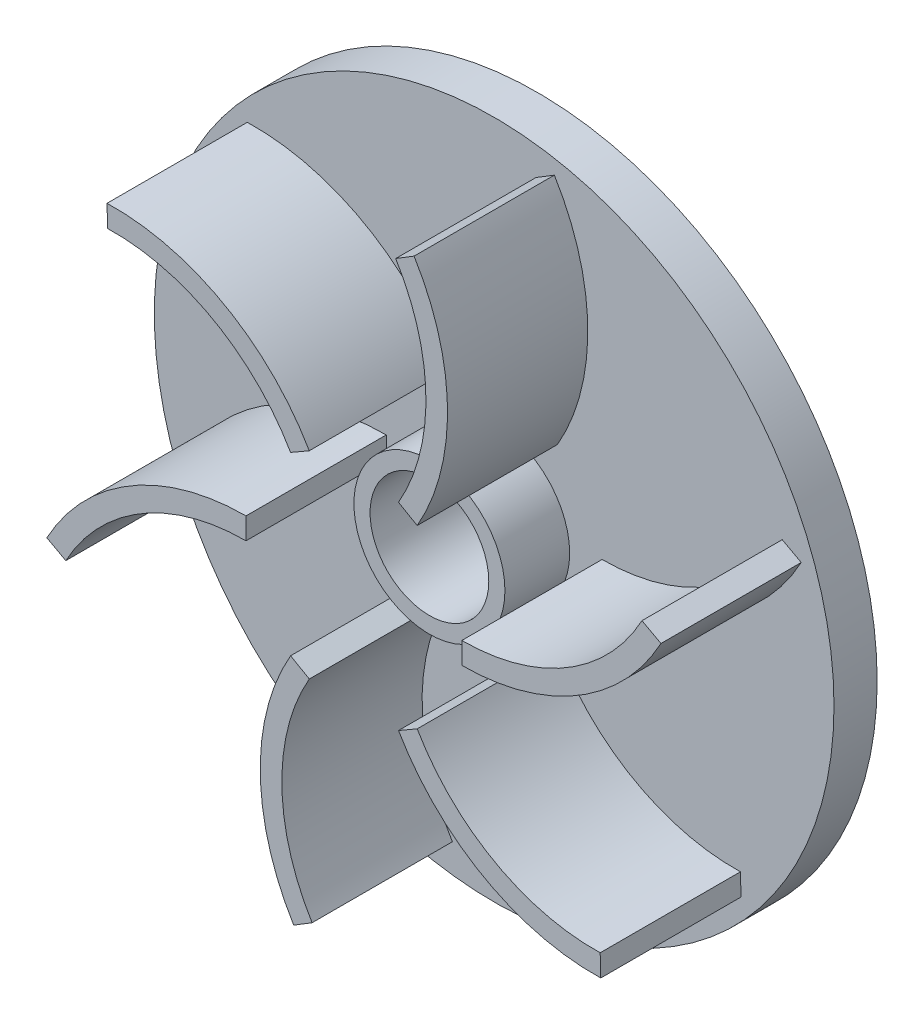
ISO-10303-21;
HEADER;
FILE_DESCRIPTION(('STEP AP214'),'2;1');
FILE_NAME('part.step','',(''),(''),'','','');
FILE_SCHEMA(('AUTOMOTIVE_DESIGN { 1 0 10303 214 1 1 1 1 }'));
ENDSEC;
DATA;
#1=APPLICATION_CONTEXT('core data for automotive mechanical design processes');
#2=APPLICATION_PROTOCOL_DEFINITION('international standard','automotive_design',2000,#1);
#3=PRODUCT_CONTEXT('',#1,'mechanical');
#4=PRODUCT('Part','Part','',(#3));
#5=PRODUCT_RELATED_PRODUCT_CATEGORY('part','',(#4));
#6=PRODUCT_DEFINITION_FORMATION('','',#4);
#7=PRODUCT_DEFINITION_CONTEXT('part definition',#1,'design');
#8=PRODUCT_DEFINITION('design','',#6,#7);
#9=PRODUCT_DEFINITION_SHAPE('','',#8);
#10=(LENGTH_UNIT() NAMED_UNIT(*) SI_UNIT(.MILLI.,.METRE.));
#11=(NAMED_UNIT(*) PLANE_ANGLE_UNIT() SI_UNIT($,.RADIAN.));
#12=(NAMED_UNIT(*) SI_UNIT($,.STERADIAN.) SOLID_ANGLE_UNIT());
#13=UNCERTAINTY_MEASURE_WITH_UNIT(LENGTH_MEASURE(1.E-05),#10,'distance_accuracy_value','');
#14=(GEOMETRIC_REPRESENTATION_CONTEXT(3) GLOBAL_UNCERTAINTY_ASSIGNED_CONTEXT((#13)) GLOBAL_UNIT_ASSIGNED_CONTEXT((#10,
#11,#12)) REPRESENTATION_CONTEXT('',''));
#15=CARTESIAN_POINT('',(0.,0.,0.));
#16=DIRECTION('',(0.,0.,1.));
#17=DIRECTION('',(1.,0.,0.));
#18=AXIS2_PLACEMENT_3D('',#15,#16,#17);
#19=CARTESIAN_POINT('',(0.,0.,4.));
#20=DIRECTION('',(0.,0.,1.));
#21=DIRECTION('',(1.,0.,0.));
#22=AXIS2_PLACEMENT_3D('',#19,#20,#21);
#23=PLANE('',#22);
#24=DIRECTION('',(0.852376936126795,0.522927871468999,0.));
#25=VECTOR('',#24,1.);
#26=CARTESIAN_POINT('',(3.87465371072056,28.5958835957555,4.));
#27=LINE('',#26,#25);
#28=CARTESIAN_POINT('',(3.87465371072056,28.5958835957555,4.));
#29=VERTEX_POINT('',#28);
#30=CARTESIAN_POINT('',(5.57940758297415,29.6417393386935,4.));
#31=VERTEX_POINT('',#30);
#32=EDGE_CURVE('E43',#29,#31,#27,.T.);
#33=ORIENTED_EDGE('',*,*,#32,.T.);
#34=CARTESIAN_POINT('',(-12.3205080756886,18.6602540378445,4.));
#35=DIRECTION('',(0.,0.,1.));
#36=DIRECTION('',(0.50000000000001,0.866025403784433,0.));
#37=AXIS2_PLACEMENT_3D('',#34,#35,#36);
#38=CIRCLE('',#37,21.);
#39=CARTESIAN_POINT('',(5.86602540378455,8.16025403784431,4.));
#40=VERTEX_POINT('',#39);
#41=EDGE_CURVE('E186',#40,#31,#38,.T.);
#42=ORIENTED_EDGE('',*,*,#41,.F.);
#43=DIRECTION('',(-0.866025403784433,0.50000000000001,0.));
#44=VECTOR('',#43,1.);
#45=CARTESIAN_POINT('',(5.86602540378455,8.16025403784431,4.));
#46=LINE('',#45,#44);
#47=CARTESIAN_POINT('',(4.13397459621568,9.16025403784433,4.));
#48=VERTEX_POINT('',#47);
#49=EDGE_CURVE('E190',#40,#48,#46,.T.);
#50=ORIENTED_EDGE('',*,*,#49,.T.);
#51=CARTESIAN_POINT('',(-12.3205080756886,18.6602540378445,4.));
#52=DIRECTION('',(0.,0.,1.));
#53=DIRECTION('',(0.50000000000001,0.866025403784433,0.));
#54=AXIS2_PLACEMENT_3D('',#51,#52,#53);
#55=CIRCLE('',#54,19.);
#56=EDGE_CURVE('E48',#48,#29,#55,.T.);
#57=ORIENTED_EDGE('',*,*,#56,.T.);
#58=EDGE_LOOP('',(#33,#42,#50,#57));
#59=FACE_BOUND('',#58,.T.);
#60=DIRECTION('',(-0.879057289102476,0.476716144551247,0.));
#61=VECTOR('',#60,1.);
#62=CARTESIAN_POINT('',(-26.7020884929472,-10.9423932535262,4.));
#63=LINE('',#62,#61);
#64=CARTESIAN_POINT('',(-26.7020884929472,-10.9423932535262,4.));
#65=VERTEX_POINT('',#64);
#66=CARTESIAN_POINT('',(-28.4602030711522,-9.98896096442374,4.));
#67=VERTEX_POINT('',#66);
#68=EDGE_CURVE('E259',#65,#67,#63,.T.);
#69=ORIENTED_EDGE('',*,*,#68,.T.);
#70=CARTESIAN_POINT('',(-10.0000000000001,-19.9999999999999,4.));
#71=DIRECTION('',(0.,0.,1.));
#72=DIRECTION('',(-1.,0.,0.));
#73=AXIS2_PLACEMENT_3D('',#70,#71,#72);
#74=CIRCLE('',#73,21.);
#75=CARTESIAN_POINT('',(-9.99999999999999,1.00000000000009,4.));
#76=VERTEX_POINT('',#75);
#77=EDGE_CURVE('E256',#76,#67,#74,.T.);
#78=ORIENTED_EDGE('',*,*,#77,.F.);
#79=DIRECTION('',(0.,-1.,0.));
#80=VECTOR('',#79,1.);
#81=CARTESIAN_POINT('',(-9.99999999999999,1.00000000000009,4.));
#82=LINE('',#81,#80);
#83=CARTESIAN_POINT('',(-10.,-0.999999999999914,4.));
#84=VERTEX_POINT('',#83);
#85=EDGE_CURVE('E263',#76,#84,#82,.T.);
#86=ORIENTED_EDGE('',*,*,#85,.T.);
#87=CARTESIAN_POINT('',(-10.0000000000001,-19.9999999999999,4.));
#88=DIRECTION('',(0.,0.,1.));
#89=DIRECTION('',(-1.,0.,0.));
#90=AXIS2_PLACEMENT_3D('',#87,#88,#89);
#91=CIRCLE('',#90,19.);
#92=EDGE_CURVE('E261',#84,#65,#91,.T.);
#93=ORIENTED_EDGE('',*,*,#92,.T.);
#94=EDGE_LOOP('',(#69,#78,#86,#93));
#95=FACE_BOUND('',#94,.T.);
#96=DIRECTION('',(0.0266803529756886,-0.999644016020249,0.));
#97=VECTOR('',#96,1.);
#98=CARTESIAN_POINT('',(22.8274347822269,-17.6534903422292,4.));
#99=LINE('',#98,#97);
#100=CARTESIAN_POINT('',(22.8274347822269,-17.6534903422292,4.));
#101=VERTEX_POINT('',#100);
#102=CARTESIAN_POINT('',(22.8807954881782,-19.6527783742697,4.));
#103=VERTEX_POINT('',#102);
#104=EDGE_CURVE('E323',#101,#103,#99,.T.);
#105=ORIENTED_EDGE('',*,*,#104,.T.);
#106=CARTESIAN_POINT('',(22.3205080756888,1.33974596215556,4.));
#107=DIRECTION('',(0.,0.,1.));
#108=DIRECTION('',(0.499999999999998,-0.86602540378444,0.));
#109=AXIS2_PLACEMENT_3D('',#106,#107,#108);
#110=CIRCLE('',#109,21.);
#111=CARTESIAN_POINT('',(4.13397459621552,-9.1602540378444,4.));
#112=VERTEX_POINT('',#111);
#113=EDGE_CURVE('E320',#112,#103,#110,.T.);
#114=ORIENTED_EDGE('',*,*,#113,.F.);
#115=DIRECTION('',(0.86602540378444,0.499999999999998,0.));
#116=VECTOR('',#115,1.);
#117=CARTESIAN_POINT('',(4.13397459621552,-9.1602540378444,4.));
#118=LINE('',#117,#116);
#119=CARTESIAN_POINT('',(5.8660254037844,-8.16025403784441,4.));
#120=VERTEX_POINT('',#119);
#121=EDGE_CURVE('E327',#112,#120,#118,.T.);
#122=ORIENTED_EDGE('',*,*,#121,.T.);
#123=CARTESIAN_POINT('',(22.3205080756888,1.33974596215556,4.));
#124=DIRECTION('',(0.,0.,1.));
#125=DIRECTION('',(0.499999999999998,-0.86602540378444,0.));
#126=AXIS2_PLACEMENT_3D('',#123,#124,#125);
#127=CIRCLE('',#126,19.);
#128=EDGE_CURVE('E325',#120,#101,#127,.T.);
#129=ORIENTED_EDGE('',*,*,#128,.T.);
#130=EDGE_LOOP('',(#105,#114,#122,#129));
#131=FACE_BOUND('',#130,.T.);
#132=CARTESIAN_POINT('',(0.,0.,4.));
#133=DIRECTION('',(0.,0.,1.));
#134=DIRECTION('',(1.,0.,0.));
#135=AXIS2_PLACEMENT_3D('',#132,#133,#134);
#136=CIRCLE('',#135,31.5);
#137=CARTESIAN_POINT('',(31.5,0.,4.));
#138=VERTEX_POINT('',#137);
#139=EDGE_CURVE('E12',#138,#138,#136,.T.);
#140=ORIENTED_EDGE('',*,*,#139,.T.);
#141=EDGE_LOOP('',(#140));
#142=FACE_BOUND('',#141,.T.);
#143=DIRECTION('',(0.87905728910248,-0.476716144551241,0.));
#144=VECTOR('',#143,1.);
#145=CARTESIAN_POINT('',(26.7020884929471,10.9423932535264,4.));
#146=LINE('',#145,#144);
#147=CARTESIAN_POINT('',(26.7020884929471,10.9423932535264,4.));
#148=VERTEX_POINT('',#147);
#149=CARTESIAN_POINT('',(28.4602030711521,9.98896096442394,4.));
#150=VERTEX_POINT('',#149);
#151=EDGE_CURVE('E355',#148,#150,#146,.T.);
#152=ORIENTED_EDGE('',*,*,#151,.T.);
#153=CARTESIAN_POINT('',(10.,20.,4.));
#154=DIRECTION('',(0.,0.,1.));
#155=DIRECTION('',(1.,0.,0.));
#156=AXIS2_PLACEMENT_3D('',#153,#154,#155);
#157=CIRCLE('',#156,21.);
#158=CARTESIAN_POINT('',(10.,-1.00000000000002,4.));
#159=VERTEX_POINT('',#158);
#160=EDGE_CURVE('E352',#159,#150,#157,.T.);
#161=ORIENTED_EDGE('',*,*,#160,.F.);
#162=DIRECTION('',(0.,1.,0.));
#163=VECTOR('',#162,1.);
#164=CARTESIAN_POINT('',(10.,-1.00000000000002,4.));
#165=LINE('',#164,#163);
#166=CARTESIAN_POINT('',(10.,0.999999999999984,4.));
#167=VERTEX_POINT('',#166);
#168=EDGE_CURVE('E359',#159,#167,#165,.T.);
#169=ORIENTED_EDGE('',*,*,#168,.T.);
#170=CARTESIAN_POINT('',(10.,20.,4.));
#171=DIRECTION('',(0.,0.,1.));
#172=DIRECTION('',(1.,0.,0.));
#173=AXIS2_PLACEMENT_3D('',#170,#171,#172);
#174=CIRCLE('',#173,19.);
#175=EDGE_CURVE('E357',#167,#148,#174,.T.);
#176=ORIENTED_EDGE('',*,*,#175,.T.);
#177=EDGE_LOOP('',(#152,#161,#169,#176));
#178=FACE_BOUND('',#177,.T.);
#179=DIRECTION('',(-0.852376936126791,-0.522927871469005,0.));
#180=VECTOR('',#179,1.);
#181=CARTESIAN_POINT('',(-3.87465371072036,-28.5958835957555,4.));
#182=LINE('',#181,#180);
#183=CARTESIAN_POINT('',(-3.87465371072036,-28.5958835957555,4.));
#184=VERTEX_POINT('',#183);
#185=CARTESIAN_POINT('',(-5.57940758297395,-29.6417393386936,4.));
#186=VERTEX_POINT('',#185);
#187=EDGE_CURVE('E291',#184,#186,#182,.T.);
#188=ORIENTED_EDGE('',*,*,#187,.T.);
#189=CARTESIAN_POINT('',(12.3205080756887,-18.6602540378444,4.));
#190=DIRECTION('',(0.,0.,1.));
#191=DIRECTION('',(-0.500000000000004,-0.866025403784436,0.));
#192=AXIS2_PLACEMENT_3D('',#189,#190,#191);
#193=CIRCLE('',#192,21.);
#194=CARTESIAN_POINT('',(-5.86602540378449,-8.16025403784435,4.));
#195=VERTEX_POINT('',#194);
#196=EDGE_CURVE('E288',#195,#186,#193,.T.);
#197=ORIENTED_EDGE('',*,*,#196,.F.);
#198=DIRECTION('',(0.866025403784436,-0.500000000000004,0.));
#199=VECTOR('',#198,1.);
#200=CARTESIAN_POINT('',(-5.86602540378449,-8.16025403784435,4.));
#201=LINE('',#200,#199);
#202=CARTESIAN_POINT('',(-4.13397459621562,-9.16025403784436,4.));
#203=VERTEX_POINT('',#202);
#204=EDGE_CURVE('E295',#195,#203,#201,.T.);
#205=ORIENTED_EDGE('',*,*,#204,.T.);
#206=CARTESIAN_POINT('',(12.3205080756887,-18.6602540378444,4.));
#207=DIRECTION('',(0.,0.,1.));
#208=DIRECTION('',(-0.500000000000004,-0.866025403784436,0.));
#209=AXIS2_PLACEMENT_3D('',#206,#207,#208);
#210=CIRCLE('',#209,19.);
#211=EDGE_CURVE('E293',#203,#184,#210,.T.);
#212=ORIENTED_EDGE('',*,*,#211,.T.);
#213=EDGE_LOOP('',(#188,#197,#205,#212));
#214=FACE_BOUND('',#213,.T.);
#215=DIRECTION('',(-0.0266803529756817,0.99964401602025,0.));
#216=VECTOR('',#215,1.);
#217=CARTESIAN_POINT('',(-22.8274347822267,17.6534903422294,4.));
#218=LINE('',#217,#216);
#219=CARTESIAN_POINT('',(-22.8274347822267,17.6534903422294,4.));
#220=VERTEX_POINT('',#219);
#221=CARTESIAN_POINT('',(-22.8807954881781,19.6527783742699,4.));
#222=VERTEX_POINT('',#221);
#223=EDGE_CURVE('E227',#220,#222,#218,.T.);
#224=ORIENTED_EDGE('',*,*,#223,.T.);
#225=CARTESIAN_POINT('',(-22.3205080756888,-1.33974596215541,4.));
#226=DIRECTION('',(0.,0.,1.));
#227=DIRECTION('',(-0.499999999999992,0.866025403784443,0.));
#228=AXIS2_PLACEMENT_3D('',#225,#226,#227);
#229=CIRCLE('',#228,21.);
#230=CARTESIAN_POINT('',(-4.13397459621546,9.16025403784443,4.));
#231=VERTEX_POINT('',#230);
#232=EDGE_CURVE('E224',#231,#222,#229,.T.);
#233=ORIENTED_EDGE('',*,*,#232,.F.);
#234=DIRECTION('',(-0.866025403784443,-0.499999999999992,0.));
#235=VECTOR('',#234,1.);
#236=CARTESIAN_POINT('',(-4.13397459621546,9.16025403784443,4.));
#237=LINE('',#236,#235);
#238=CARTESIAN_POINT('',(-5.86602540378435,8.16025403784445,4.));
#239=VERTEX_POINT('',#238);
#240=EDGE_CURVE('E231',#231,#239,#237,.T.);
#241=ORIENTED_EDGE('',*,*,#240,.T.);
#242=CARTESIAN_POINT('',(-22.3205080756888,-1.33974596215541,4.));
#243=DIRECTION('',(0.,0.,1.));
#244=DIRECTION('',(-0.499999999999992,0.866025403784443,0.));
#245=AXIS2_PLACEMENT_3D('',#242,#243,#244);
#246=CIRCLE('',#245,19.);
#247=EDGE_CURVE('E229',#239,#220,#246,.T.);
#248=ORIENTED_EDGE('',*,*,#247,.T.);
#249=EDGE_LOOP('',(#224,#233,#241,#248));
#250=FACE_BOUND('',#249,.T.);
#251=CARTESIAN_POINT('',(0.,0.,4.));
#252=DIRECTION('',(0.,0.,1.));
#253=DIRECTION('',(1.,0.,0.));
#254=AXIS2_PLACEMENT_3D('',#251,#252,#253);
#255=CIRCLE('',#254,7.);
#256=CARTESIAN_POINT('',(7.,0.,4.));
#257=VERTEX_POINT('',#256);
#258=EDGE_CURVE('E563',#257,#257,#255,.T.);
#259=ORIENTED_EDGE('',*,*,#258,.F.);
#260=EDGE_LOOP('',(#259));
#261=FACE_BOUND('',#260,.T.);
#262=ADVANCED_FACE('F28',(#59,#95,#131,#142,#178,#214,#250,#261),#23,.T.);
#263=CARTESIAN_POINT('',(0.,0.,4.));
#264=DIRECTION('',(0.,0.,-1.));
#265=DIRECTION('',(-1.,0.,0.));
#266=AXIS2_PLACEMENT_3D('',#263,#264,#265);
#267=CYLINDRICAL_SURFACE('',#266,31.5);
#268=ORIENTED_EDGE('',*,*,#139,.F.);
#269=EDGE_LOOP('',(#268));
#270=FACE_BOUND('',#269,.T.);
#271=CARTESIAN_POINT('',(0.,0.,0.));
#272=DIRECTION('',(0.,0.,1.));
#273=DIRECTION('',(1.,0.,0.));
#274=AXIS2_PLACEMENT_3D('',#271,#272,#273);
#275=CIRCLE('',#274,31.5);
#276=CARTESIAN_POINT('',(31.5,0.,0.));
#277=VERTEX_POINT('',#276);
#278=EDGE_CURVE('E36',#277,#277,#275,.T.);
#279=ORIENTED_EDGE('',*,*,#278,.T.);
#280=EDGE_LOOP('',(#279));
#281=FACE_BOUND('',#280,.T.);
#282=ADVANCED_FACE('F30',(#270,#281),#267,.T.);
#283=CARTESIAN_POINT('',(0.,0.,0.));
#284=DIRECTION('',(0.,0.,1.));
#285=DIRECTION('',(1.,0.,0.));
#286=AXIS2_PLACEMENT_3D('',#283,#284,#285);
#287=PLANE('',#286);
#288=CARTESIAN_POINT('',(0.,0.,0.));
#289=DIRECTION('',(0.,0.,1.));
#290=DIRECTION('',(1.,0.,0.));
#291=AXIS2_PLACEMENT_3D('',#288,#289,#290);
#292=CIRCLE('',#291,5.5);
#293=CARTESIAN_POINT('',(5.5,0.,0.));
#294=VERTEX_POINT('',#293);
#295=EDGE_CURVE('E569',#294,#294,#292,.T.);
#296=ORIENTED_EDGE('',*,*,#295,.T.);
#297=EDGE_LOOP('',(#296));
#298=FACE_BOUND('',#297,.T.);
#299=ORIENTED_EDGE('',*,*,#278,.F.);
#300=EDGE_LOOP('',(#299));
#301=FACE_BOUND('',#300,.T.);
#302=ADVANCED_FACE('F387',(#298,#301),#287,.F.);
#303=CARTESIAN_POINT('',(10.,20.,17.));
#304=DIRECTION('',(0.,0.,-1.));
#305=DIRECTION('',(-1.,0.,0.));
#306=AXIS2_PLACEMENT_3D('',#303,#304,#305);
#307=CYLINDRICAL_SURFACE('',#306,21.);
#308=ORIENTED_EDGE('',*,*,#160,.T.);
#309=DIRECTION('',(0.,0.,-1.));
#310=VECTOR('',#309,1.);
#311=CARTESIAN_POINT('',(28.4602030711521,9.98896096442394,17.));
#312=LINE('',#311,#310);
#313=CARTESIAN_POINT('',(28.4602030711521,9.98896096442394,17.));
#314=VERTEX_POINT('',#313);
#315=EDGE_CURVE('E381',#314,#150,#312,.T.);
#316=ORIENTED_EDGE('',*,*,#315,.F.);
#317=CARTESIAN_POINT('',(10.,20.,17.));
#318=DIRECTION('',(0.,0.,1.));
#319=DIRECTION('',(1.,0.,0.));
#320=AXIS2_PLACEMENT_3D('',#317,#318,#319);
#321=CIRCLE('',#320,21.);
#322=CARTESIAN_POINT('',(10.,-1.00000000000002,17.));
#323=VERTEX_POINT('',#322);
#324=EDGE_CURVE('E361',#323,#314,#321,.T.);
#325=ORIENTED_EDGE('',*,*,#324,.F.);
#326=DIRECTION('',(0.,0.,-1.));
#327=VECTOR('',#326,1.);
#328=CARTESIAN_POINT('',(10.,-1.00000000000002,17.));
#329=LINE('',#328,#327);
#330=EDGE_CURVE('E372',#323,#159,#329,.T.);
#331=ORIENTED_EDGE('',*,*,#330,.T.);
#332=EDGE_LOOP('',(#308,#316,#325,#331));
#333=FACE_BOUND('',#332,.T.);
#334=ADVANCED_FACE('F389',(#333),#307,.T.);
#335=CARTESIAN_POINT('',(26.7020884929471,10.9423932535264,17.));
#336=DIRECTION('',(0.476716144551241,0.87905728910248,0.));
#337=DIRECTION('',(-0.87905728910248,0.476716144551241,0.));
#338=AXIS2_PLACEMENT_3D('',#335,#336,#337);
#339=PLANE('',#338);
#340=ORIENTED_EDGE('',*,*,#151,.F.);
#341=DIRECTION('',(0.,0.,-1.));
#342=VECTOR('',#341,1.);
#343=CARTESIAN_POINT('',(26.7020884929471,10.9423932535264,17.));
#344=LINE('',#343,#342);
#345=CARTESIAN_POINT('',(26.7020884929471,10.9423932535264,17.));
#346=VERTEX_POINT('',#345);
#347=EDGE_CURVE('E378',#346,#148,#344,.T.);
#348=ORIENTED_EDGE('',*,*,#347,.F.);
#349=DIRECTION('',(0.87905728910248,-0.476716144551241,0.));
#350=VECTOR('',#349,1.);
#351=CARTESIAN_POINT('',(26.7020884929471,10.9423932535264,17.));
#352=LINE('',#351,#350);
#353=EDGE_CURVE('E363',#346,#314,#352,.T.);
#354=ORIENTED_EDGE('',*,*,#353,.T.);
#355=ORIENTED_EDGE('',*,*,#315,.T.);
#356=EDGE_LOOP('',(#340,#348,#354,#355));
#357=FACE_BOUND('',#356,.T.);
#358=ADVANCED_FACE('F397',(#357),#339,.T.);
#359=CARTESIAN_POINT('',(10.,20.,17.));
#360=DIRECTION('',(0.,0.,-1.));
#361=DIRECTION('',(-1.,0.,0.));
#362=AXIS2_PLACEMENT_3D('',#359,#360,#361);
#363=CYLINDRICAL_SURFACE('',#362,19.);
#364=ORIENTED_EDGE('',*,*,#175,.F.);
#365=DIRECTION('',(0.,0.,-1.));
#366=VECTOR('',#365,1.);
#367=CARTESIAN_POINT('',(10.,0.999999999999984,17.));
#368=LINE('',#367,#366);
#369=CARTESIAN_POINT('',(10.,0.999999999999984,17.));
#370=VERTEX_POINT('',#369);
#371=EDGE_CURVE('E375',#370,#167,#368,.T.);
#372=ORIENTED_EDGE('',*,*,#371,.F.);
#373=CARTESIAN_POINT('',(10.,20.,17.));
#374=DIRECTION('',(0.,0.,1.));
#375=DIRECTION('',(1.,0.,0.));
#376=AXIS2_PLACEMENT_3D('',#373,#374,#375);
#377=CIRCLE('',#376,19.);
#378=EDGE_CURVE('E366',#370,#346,#377,.T.);
#379=ORIENTED_EDGE('',*,*,#378,.T.);
#380=ORIENTED_EDGE('',*,*,#347,.T.);
#381=EDGE_LOOP('',(#364,#372,#379,#380));
#382=FACE_BOUND('',#381,.T.);
#383=ADVANCED_FACE('F538',(#382),#363,.F.);
#384=CARTESIAN_POINT('',(10.,-1.00000000000002,17.));
#385=DIRECTION('',(-1.,0.,0.));
#386=DIRECTION('',(0.,0.,1.));
#387=AXIS2_PLACEMENT_3D('',#384,#385,#386);
#388=PLANE('',#387);
#389=ORIENTED_EDGE('',*,*,#168,.F.);
#390=ORIENTED_EDGE('',*,*,#330,.F.);
#391=DIRECTION('',(0.,1.,0.));
#392=VECTOR('',#391,1.);
#393=CARTESIAN_POINT('',(10.,-1.00000000000002,17.));
#394=LINE('',#393,#392);
#395=EDGE_CURVE('E369',#323,#370,#394,.T.);
#396=ORIENTED_EDGE('',*,*,#395,.T.);
#397=ORIENTED_EDGE('',*,*,#371,.T.);
#398=EDGE_LOOP('',(#389,#390,#396,#397));
#399=FACE_BOUND('',#398,.T.);
#400=ADVANCED_FACE('F534',(#399),#388,.T.);
#401=CARTESIAN_POINT('',(10.,20.,17.));
#402=DIRECTION('',(0.,0.,1.));
#403=DIRECTION('',(1.,0.,0.));
#404=AXIS2_PLACEMENT_3D('',#401,#402,#403);
#405=PLANE('',#404);
#406=ORIENTED_EDGE('',*,*,#324,.T.);
#407=ORIENTED_EDGE('',*,*,#353,.F.);
#408=ORIENTED_EDGE('',*,*,#378,.F.);
#409=ORIENTED_EDGE('',*,*,#395,.F.);
#410=EDGE_LOOP('',(#406,#407,#408,#409));
#411=FACE_BOUND('',#410,.T.);
#412=ADVANCED_FACE('F530',(#411),#405,.T.);
#413=CARTESIAN_POINT('',(22.3205080756888,1.33974596215556,17.));
#414=DIRECTION('',(0.,0.,-1.));
#415=DIRECTION('',(-1.,0.,0.));
#416=AXIS2_PLACEMENT_3D('',#413,#414,#415);
#417=CYLINDRICAL_SURFACE('',#416,21.);
#418=ORIENTED_EDGE('',*,*,#113,.T.);
#419=DIRECTION('',(0.,0.,-1.));
#420=VECTOR('',#419,1.);
#421=CARTESIAN_POINT('',(22.8807954881782,-19.6527783742697,17.));
#422=LINE('',#421,#420);
#423=CARTESIAN_POINT('',(22.8807954881782,-19.6527783742697,17.));
#424=VERTEX_POINT('',#423);
#425=EDGE_CURVE('E349',#424,#103,#422,.T.);
#426=ORIENTED_EDGE('',*,*,#425,.F.);
#427=CARTESIAN_POINT('',(22.3205080756888,1.33974596215556,17.));
#428=DIRECTION('',(0.,0.,1.));
#429=DIRECTION('',(0.499999999999998,-0.86602540378444,0.));
#430=AXIS2_PLACEMENT_3D('',#427,#428,#429);
#431=CIRCLE('',#430,21.);
#432=CARTESIAN_POINT('',(4.13397459621552,-9.1602540378444,17.));
#433=VERTEX_POINT('',#432);
#434=EDGE_CURVE('E329',#433,#424,#431,.T.);
#435=ORIENTED_EDGE('',*,*,#434,.F.);
#436=DIRECTION('',(0.,0.,-1.));
#437=VECTOR('',#436,1.);
#438=CARTESIAN_POINT('',(4.13397459621552,-9.1602540378444,17.));
#439=LINE('',#438,#437);
#440=EDGE_CURVE('E340',#433,#112,#439,.T.);
#441=ORIENTED_EDGE('',*,*,#440,.T.);
#442=EDGE_LOOP('',(#418,#426,#435,#441));
#443=FACE_BOUND('',#442,.T.);
#444=ADVANCED_FACE('F526',(#443),#417,.T.);
#445=CARTESIAN_POINT('',(22.8274347822269,-17.6534903422292,17.));
#446=DIRECTION('',(0.999644016020249,0.0266803529756886,0.));
#447=DIRECTION('',(-0.0266803529756886,0.99964401602025,0.));
#448=AXIS2_PLACEMENT_3D('',#445,#446,#447);
#449=PLANE('',#448);
#450=ORIENTED_EDGE('',*,*,#104,.F.);
#451=DIRECTION('',(0.,0.,-1.));
#452=VECTOR('',#451,1.);
#453=CARTESIAN_POINT('',(22.8274347822269,-17.6534903422292,17.));
#454=LINE('',#453,#452);
#455=CARTESIAN_POINT('',(22.8274347822269,-17.6534903422292,17.));
#456=VERTEX_POINT('',#455);
#457=EDGE_CURVE('E346',#456,#101,#454,.T.);
#458=ORIENTED_EDGE('',*,*,#457,.F.);
#459=DIRECTION('',(0.0266803529756886,-0.999644016020249,0.));
#460=VECTOR('',#459,1.);
#461=CARTESIAN_POINT('',(22.8274347822269,-17.6534903422292,17.));
#462=LINE('',#461,#460);
#463=EDGE_CURVE('E331',#456,#424,#462,.T.);
#464=ORIENTED_EDGE('',*,*,#463,.T.);
#465=ORIENTED_EDGE('',*,*,#425,.T.);
#466=EDGE_LOOP('',(#450,#458,#464,#465));
#467=FACE_BOUND('',#466,.T.);
#468=ADVANCED_FACE('F522',(#467),#449,.T.);
#469=CARTESIAN_POINT('',(22.3205080756888,1.33974596215556,17.));
#470=DIRECTION('',(0.,0.,-1.));
#471=DIRECTION('',(-1.,0.,0.));
#472=AXIS2_PLACEMENT_3D('',#469,#470,#471);
#473=CYLINDRICAL_SURFACE('',#472,19.);
#474=ORIENTED_EDGE('',*,*,#128,.F.);
#475=DIRECTION('',(0.,0.,-1.));
#476=VECTOR('',#475,1.);
#477=CARTESIAN_POINT('',(5.8660254037844,-8.16025403784441,17.));
#478=LINE('',#477,#476);
#479=CARTESIAN_POINT('',(5.8660254037844,-8.16025403784441,17.));
#480=VERTEX_POINT('',#479);
#481=EDGE_CURVE('E343',#480,#120,#478,.T.);
#482=ORIENTED_EDGE('',*,*,#481,.F.);
#483=CARTESIAN_POINT('',(22.3205080756888,1.33974596215556,17.));
#484=DIRECTION('',(0.,0.,1.));
#485=DIRECTION('',(0.499999999999998,-0.86602540378444,0.));
#486=AXIS2_PLACEMENT_3D('',#483,#484,#485);
#487=CIRCLE('',#486,19.);
#488=EDGE_CURVE('E334',#480,#456,#487,.T.);
#489=ORIENTED_EDGE('',*,*,#488,.T.);
#490=ORIENTED_EDGE('',*,*,#457,.T.);
#491=EDGE_LOOP('',(#474,#482,#489,#490));
#492=FACE_BOUND('',#491,.T.);
#493=ADVANCED_FACE('F518',(#492),#473,.F.);
#494=CARTESIAN_POINT('',(4.13397459621552,-9.1602540378444,17.));
#495=DIRECTION('',(-0.499999999999998,0.86602540378444,0.));
#496=DIRECTION('',(-0.86602540378444,-0.499999999999998,0.));
#497=AXIS2_PLACEMENT_3D('',#494,#495,#496);
#498=PLANE('',#497);
#499=ORIENTED_EDGE('',*,*,#121,.F.);
#500=ORIENTED_EDGE('',*,*,#440,.F.);
#501=DIRECTION('',(0.86602540378444,0.499999999999998,0.));
#502=VECTOR('',#501,1.);
#503=CARTESIAN_POINT('',(4.13397459621552,-9.1602540378444,17.));
#504=LINE('',#503,#502);
#505=EDGE_CURVE('E337',#433,#480,#504,.T.);
#506=ORIENTED_EDGE('',*,*,#505,.T.);
#507=ORIENTED_EDGE('',*,*,#481,.T.);
#508=EDGE_LOOP('',(#499,#500,#506,#507));
#509=FACE_BOUND('',#508,.T.);
#510=ADVANCED_FACE('F514',(#509),#498,.T.);
#511=CARTESIAN_POINT('',(22.3205080756888,1.33974596215556,17.));
#512=DIRECTION('',(0.,0.,1.));
#513=DIRECTION('',(1.,0.,0.));
#514=AXIS2_PLACEMENT_3D('',#511,#512,#513);
#515=PLANE('',#514);
#516=ORIENTED_EDGE('',*,*,#434,.T.);
#517=ORIENTED_EDGE('',*,*,#463,.F.);
#518=ORIENTED_EDGE('',*,*,#488,.F.);
#519=ORIENTED_EDGE('',*,*,#505,.F.);
#520=EDGE_LOOP('',(#516,#517,#518,#519));
#521=FACE_BOUND('',#520,.T.);
#522=ADVANCED_FACE('F510',(#521),#515,.T.);
#523=CARTESIAN_POINT('',(12.3205080756887,-18.6602540378444,17.));
#524=DIRECTION('',(0.,0.,-1.));
#525=DIRECTION('',(-1.,0.,0.));
#526=AXIS2_PLACEMENT_3D('',#523,#524,#525);
#527=CYLINDRICAL_SURFACE('',#526,21.);
#528=ORIENTED_EDGE('',*,*,#196,.T.);
#529=DIRECTION('',(0.,0.,-1.));
#530=VECTOR('',#529,1.);
#531=CARTESIAN_POINT('',(-5.57940758297395,-29.6417393386936,17.));
#532=LINE('',#531,#530);
#533=CARTESIAN_POINT('',(-5.57940758297395,-29.6417393386936,17.));
#534=VERTEX_POINT('',#533);
#535=EDGE_CURVE('E317',#534,#186,#532,.T.);
#536=ORIENTED_EDGE('',*,*,#535,.F.);
#537=CARTESIAN_POINT('',(12.3205080756887,-18.6602540378444,17.));
#538=DIRECTION('',(0.,0.,1.));
#539=DIRECTION('',(-0.500000000000004,-0.866025403784436,0.));
#540=AXIS2_PLACEMENT_3D('',#537,#538,#539);
#541=CIRCLE('',#540,21.);
#542=CARTESIAN_POINT('',(-5.86602540378449,-8.16025403784435,17.));
#543=VERTEX_POINT('',#542);
#544=EDGE_CURVE('E297',#543,#534,#541,.T.);
#545=ORIENTED_EDGE('',*,*,#544,.F.);
#546=DIRECTION('',(0.,0.,-1.));
#547=VECTOR('',#546,1.);
#548=CARTESIAN_POINT('',(-5.86602540378449,-8.16025403784435,17.));
#549=LINE('',#548,#547);
#550=EDGE_CURVE('E308',#543,#195,#549,.T.);
#551=ORIENTED_EDGE('',*,*,#550,.T.);
#552=EDGE_LOOP('',(#528,#536,#545,#551));
#553=FACE_BOUND('',#552,.T.);
#554=ADVANCED_FACE('F506',(#553),#527,.T.);
#555=CARTESIAN_POINT('',(-3.87465371072036,-28.5958835957555,17.));
#556=DIRECTION('',(0.522927871469005,-0.852376936126791,0.));
#557=DIRECTION('',(0.852376936126791,0.522927871469005,0.));
#558=AXIS2_PLACEMENT_3D('',#555,#556,#557);
#559=PLANE('',#558);
#560=ORIENTED_EDGE('',*,*,#187,.F.);
#561=DIRECTION('',(0.,0.,-1.));
#562=VECTOR('',#561,1.);
#563=CARTESIAN_POINT('',(-3.87465371072036,-28.5958835957555,17.));
#564=LINE('',#563,#562);
#565=CARTESIAN_POINT('',(-3.87465371072036,-28.5958835957555,17.));
#566=VERTEX_POINT('',#565);
#567=EDGE_CURVE('E314',#566,#184,#564,.T.);
#568=ORIENTED_EDGE('',*,*,#567,.F.);
#569=DIRECTION('',(-0.852376936126791,-0.522927871469005,0.));
#570=VECTOR('',#569,1.);
#571=CARTESIAN_POINT('',(-3.87465371072036,-28.5958835957555,17.));
#572=LINE('',#571,#570);
#573=EDGE_CURVE('E299',#566,#534,#572,.T.);
#574=ORIENTED_EDGE('',*,*,#573,.T.);
#575=ORIENTED_EDGE('',*,*,#535,.T.);
#576=EDGE_LOOP('',(#560,#568,#574,#575));
#577=FACE_BOUND('',#576,.T.);
#578=ADVANCED_FACE('F502',(#577),#559,.T.);
#579=CARTESIAN_POINT('',(12.3205080756887,-18.6602540378444,17.));
#580=DIRECTION('',(0.,0.,-1.));
#581=DIRECTION('',(-1.,0.,0.));
#582=AXIS2_PLACEMENT_3D('',#579,#580,#581);
#583=CYLINDRICAL_SURFACE('',#582,19.);
#584=ORIENTED_EDGE('',*,*,#211,.F.);
#585=DIRECTION('',(0.,0.,-1.));
#586=VECTOR('',#585,1.);
#587=CARTESIAN_POINT('',(-4.13397459621562,-9.16025403784436,17.));
#588=LINE('',#587,#586);
#589=CARTESIAN_POINT('',(-4.13397459621562,-9.16025403784436,17.));
#590=VERTEX_POINT('',#589);
#591=EDGE_CURVE('E311',#590,#203,#588,.T.);
#592=ORIENTED_EDGE('',*,*,#591,.F.);
#593=CARTESIAN_POINT('',(12.3205080756887,-18.6602540378444,17.));
#594=DIRECTION('',(0.,0.,1.));
#595=DIRECTION('',(-0.500000000000004,-0.866025403784436,0.));
#596=AXIS2_PLACEMENT_3D('',#593,#594,#595);
#597=CIRCLE('',#596,19.);
#598=EDGE_CURVE('E302',#590,#566,#597,.T.);
#599=ORIENTED_EDGE('',*,*,#598,.T.);
#600=ORIENTED_EDGE('',*,*,#567,.T.);
#601=EDGE_LOOP('',(#584,#592,#599,#600));
#602=FACE_BOUND('',#601,.T.);
#603=ADVANCED_FACE('F498',(#602),#583,.F.);
#604=CARTESIAN_POINT('',(-5.86602540378449,-8.16025403784435,17.));
#605=DIRECTION('',(0.500000000000004,0.866025403784436,0.));
#606=DIRECTION('',(-0.866025403784436,0.500000000000004,0.));
#607=AXIS2_PLACEMENT_3D('',#604,#605,#606);
#608=PLANE('',#607);
#609=ORIENTED_EDGE('',*,*,#204,.F.);
#610=ORIENTED_EDGE('',*,*,#550,.F.);
#611=DIRECTION('',(0.866025403784436,-0.500000000000004,0.));
#612=VECTOR('',#611,1.);
#613=CARTESIAN_POINT('',(-5.86602540378449,-8.16025403784435,17.));
#614=LINE('',#613,#612);
#615=EDGE_CURVE('E305',#543,#590,#614,.T.);
#616=ORIENTED_EDGE('',*,*,#615,.T.);
#617=ORIENTED_EDGE('',*,*,#591,.T.);
#618=EDGE_LOOP('',(#609,#610,#616,#617));
#619=FACE_BOUND('',#618,.T.);
#620=ADVANCED_FACE('F494',(#619),#608,.T.);
#621=CARTESIAN_POINT('',(12.3205080756887,-18.6602540378444,17.));
#622=DIRECTION('',(0.,0.,1.));
#623=DIRECTION('',(1.,0.,0.));
#624=AXIS2_PLACEMENT_3D('',#621,#622,#623);
#625=PLANE('',#624);
#626=ORIENTED_EDGE('',*,*,#544,.T.);
#627=ORIENTED_EDGE('',*,*,#573,.F.);
#628=ORIENTED_EDGE('',*,*,#598,.F.);
#629=ORIENTED_EDGE('',*,*,#615,.F.);
#630=EDGE_LOOP('',(#626,#627,#628,#629));
#631=FACE_BOUND('',#630,.T.);
#632=ADVANCED_FACE('F490',(#631),#625,.T.);
#633=CARTESIAN_POINT('',(-10.0000000000001,-19.9999999999999,17.));
#634=DIRECTION('',(0.,0.,-1.));
#635=DIRECTION('',(-1.,0.,0.));
#636=AXIS2_PLACEMENT_3D('',#633,#634,#635);
#637=CYLINDRICAL_SURFACE('',#636,21.);
#638=ORIENTED_EDGE('',*,*,#77,.T.);
#639=DIRECTION('',(0.,0.,-1.));
#640=VECTOR('',#639,1.);
#641=CARTESIAN_POINT('',(-28.4602030711522,-9.98896096442374,17.));
#642=LINE('',#641,#640);
#643=CARTESIAN_POINT('',(-28.4602030711522,-9.98896096442374,17.));
#644=VERTEX_POINT('',#643);
#645=EDGE_CURVE('E285',#644,#67,#642,.T.);
#646=ORIENTED_EDGE('',*,*,#645,.F.);
#647=CARTESIAN_POINT('',(-10.0000000000001,-19.9999999999999,17.));
#648=DIRECTION('',(0.,0.,1.));
#649=DIRECTION('',(-1.,0.,0.));
#650=AXIS2_PLACEMENT_3D('',#647,#648,#649);
#651=CIRCLE('',#650,21.);
#652=CARTESIAN_POINT('',(-9.99999999999999,1.00000000000009,17.));
#653=VERTEX_POINT('',#652);
#654=EDGE_CURVE('E265',#653,#644,#651,.T.);
#655=ORIENTED_EDGE('',*,*,#654,.F.);
#656=DIRECTION('',(0.,0.,-1.));
#657=VECTOR('',#656,1.);
#658=CARTESIAN_POINT('',(-9.99999999999999,1.00000000000009,17.));
#659=LINE('',#658,#657);
#660=EDGE_CURVE('E276',#653,#76,#659,.T.);
#661=ORIENTED_EDGE('',*,*,#660,.T.);
#662=EDGE_LOOP('',(#638,#646,#655,#661));
#663=FACE_BOUND('',#662,.T.);
#664=ADVANCED_FACE('F486',(#663),#637,.T.);
#665=CARTESIAN_POINT('',(-26.7020884929472,-10.9423932535262,17.));
#666=DIRECTION('',(-0.476716144551247,-0.879057289102476,0.));
#667=DIRECTION('',(0.879057289102477,-0.476716144551247,0.));
#668=AXIS2_PLACEMENT_3D('',#665,#666,#667);
#669=PLANE('',#668);
#670=ORIENTED_EDGE('',*,*,#68,.F.);
#671=DIRECTION('',(0.,0.,-1.));
#672=VECTOR('',#671,1.);
#673=CARTESIAN_POINT('',(-26.7020884929472,-10.9423932535262,17.));
#674=LINE('',#673,#672);
#675=CARTESIAN_POINT('',(-26.7020884929472,-10.9423932535262,17.));
#676=VERTEX_POINT('',#675);
#677=EDGE_CURVE('E282',#676,#65,#674,.T.);
#678=ORIENTED_EDGE('',*,*,#677,.F.);
#679=DIRECTION('',(-0.879057289102476,0.476716144551247,0.));
#680=VECTOR('',#679,1.);
#681=CARTESIAN_POINT('',(-26.7020884929472,-10.9423932535262,17.));
#682=LINE('',#681,#680);
#683=EDGE_CURVE('E267',#676,#644,#682,.T.);
#684=ORIENTED_EDGE('',*,*,#683,.T.);
#685=ORIENTED_EDGE('',*,*,#645,.T.);
#686=EDGE_LOOP('',(#670,#678,#684,#685));
#687=FACE_BOUND('',#686,.T.);
#688=ADVANCED_FACE('F482',(#687),#669,.T.);
#689=CARTESIAN_POINT('',(-10.0000000000001,-19.9999999999999,17.));
#690=DIRECTION('',(0.,0.,-1.));
#691=DIRECTION('',(-1.,0.,0.));
#692=AXIS2_PLACEMENT_3D('',#689,#690,#691);
#693=CYLINDRICAL_SURFACE('',#692,19.);
#694=ORIENTED_EDGE('',*,*,#92,.F.);
#695=DIRECTION('',(0.,0.,-1.));
#696=VECTOR('',#695,1.);
#697=CARTESIAN_POINT('',(-10.,-0.999999999999914,17.));
#698=LINE('',#697,#696);
#699=CARTESIAN_POINT('',(-10.,-0.999999999999914,17.));
#700=VERTEX_POINT('',#699);
#701=EDGE_CURVE('E279',#700,#84,#698,.T.);
#702=ORIENTED_EDGE('',*,*,#701,.F.);
#703=CARTESIAN_POINT('',(-10.0000000000001,-19.9999999999999,17.));
#704=DIRECTION('',(0.,0.,1.));
#705=DIRECTION('',(-1.,0.,0.));
#706=AXIS2_PLACEMENT_3D('',#703,#704,#705);
#707=CIRCLE('',#706,19.);
#708=EDGE_CURVE('E270',#700,#676,#707,.T.);
#709=ORIENTED_EDGE('',*,*,#708,.T.);
#710=ORIENTED_EDGE('',*,*,#677,.T.);
#711=EDGE_LOOP('',(#694,#702,#709,#710));
#712=FACE_BOUND('',#711,.T.);
#713=ADVANCED_FACE('F478',(#712),#693,.F.);
#714=CARTESIAN_POINT('',(-9.99999999999999,1.00000000000009,17.));
#715=DIRECTION('',(1.,0.,0.));
#716=DIRECTION('',(0.,1.,0.));
#717=AXIS2_PLACEMENT_3D('',#714,#715,#716);
#718=PLANE('',#717);
#719=ORIENTED_EDGE('',*,*,#85,.F.);
#720=ORIENTED_EDGE('',*,*,#660,.F.);
#721=DIRECTION('',(0.,-1.,0.));
#722=VECTOR('',#721,1.);
#723=CARTESIAN_POINT('',(-9.99999999999999,1.00000000000009,17.));
#724=LINE('',#723,#722);
#725=EDGE_CURVE('E273',#653,#700,#724,.T.);
#726=ORIENTED_EDGE('',*,*,#725,.T.);
#727=ORIENTED_EDGE('',*,*,#701,.T.);
#728=EDGE_LOOP('',(#719,#720,#726,#727));
#729=FACE_BOUND('',#728,.T.);
#730=ADVANCED_FACE('F474',(#729),#718,.T.);
#731=CARTESIAN_POINT('',(-10.0000000000001,-19.9999999999999,17.));
#732=DIRECTION('',(0.,0.,1.));
#733=DIRECTION('',(1.,0.,0.));
#734=AXIS2_PLACEMENT_3D('',#731,#732,#733);
#735=PLANE('',#734);
#736=ORIENTED_EDGE('',*,*,#654,.T.);
#737=ORIENTED_EDGE('',*,*,#683,.F.);
#738=ORIENTED_EDGE('',*,*,#708,.F.);
#739=ORIENTED_EDGE('',*,*,#725,.F.);
#740=EDGE_LOOP('',(#736,#737,#738,#739));
#741=FACE_BOUND('',#740,.T.);
#742=ADVANCED_FACE('F470',(#741),#735,.T.);
#743=CARTESIAN_POINT('',(-22.3205080756888,-1.33974596215541,17.));
#744=DIRECTION('',(0.,0.,-1.));
#745=DIRECTION('',(-1.,0.,0.));
#746=AXIS2_PLACEMENT_3D('',#743,#744,#745);
#747=CYLINDRICAL_SURFACE('',#746,21.);
#748=ORIENTED_EDGE('',*,*,#232,.T.);
#749=DIRECTION('',(0.,0.,-1.));
#750=VECTOR('',#749,1.);
#751=CARTESIAN_POINT('',(-22.8807954881781,19.6527783742699,17.));
#752=LINE('',#751,#750);
#753=CARTESIAN_POINT('',(-22.8807954881781,19.6527783742699,17.));
#754=VERTEX_POINT('',#753);
#755=EDGE_CURVE('E253',#754,#222,#752,.T.);
#756=ORIENTED_EDGE('',*,*,#755,.F.);
#757=CARTESIAN_POINT('',(-22.3205080756888,-1.33974596215541,17.));
#758=DIRECTION('',(0.,0.,1.));
#759=DIRECTION('',(-0.499999999999992,0.866025403784443,0.));
#760=AXIS2_PLACEMENT_3D('',#757,#758,#759);
#761=CIRCLE('',#760,21.);
#762=CARTESIAN_POINT('',(-4.13397459621546,9.16025403784443,17.));
#763=VERTEX_POINT('',#762);
#764=EDGE_CURVE('E233',#763,#754,#761,.T.);
#765=ORIENTED_EDGE('',*,*,#764,.F.);
#766=DIRECTION('',(0.,0.,-1.));
#767=VECTOR('',#766,1.);
#768=CARTESIAN_POINT('',(-4.13397459621546,9.16025403784443,17.));
#769=LINE('',#768,#767);
#770=EDGE_CURVE('E244',#763,#231,#769,.T.);
#771=ORIENTED_EDGE('',*,*,#770,.T.);
#772=EDGE_LOOP('',(#748,#756,#765,#771));
#773=FACE_BOUND('',#772,.T.);
#774=ADVANCED_FACE('F466',(#773),#747,.T.);
#775=CARTESIAN_POINT('',(-22.8274347822267,17.6534903422294,17.));
#776=DIRECTION('',(-0.99964401602025,-0.0266803529756817,0.));
#777=DIRECTION('',(0.0266803529756817,-0.99964401602025,0.));
#778=AXIS2_PLACEMENT_3D('',#775,#776,#777);
#779=PLANE('',#778);
#780=ORIENTED_EDGE('',*,*,#223,.F.);
#781=DIRECTION('',(0.,0.,-1.));
#782=VECTOR('',#781,1.);
#783=CARTESIAN_POINT('',(-22.8274347822267,17.6534903422294,17.));
#784=LINE('',#783,#782);
#785=CARTESIAN_POINT('',(-22.8274347822267,17.6534903422294,17.));
#786=VERTEX_POINT('',#785);
#787=EDGE_CURVE('E250',#786,#220,#784,.T.);
#788=ORIENTED_EDGE('',*,*,#787,.F.);
#789=DIRECTION('',(-0.0266803529756817,0.99964401602025,0.));
#790=VECTOR('',#789,1.);
#791=CARTESIAN_POINT('',(-22.8274347822267,17.6534903422294,17.));
#792=LINE('',#791,#790);
#793=EDGE_CURVE('E235',#786,#754,#792,.T.);
#794=ORIENTED_EDGE('',*,*,#793,.T.);
#795=ORIENTED_EDGE('',*,*,#755,.T.);
#796=EDGE_LOOP('',(#780,#788,#794,#795));
#797=FACE_BOUND('',#796,.T.);
#798=ADVANCED_FACE('F462',(#797),#779,.T.);
#799=CARTESIAN_POINT('',(-22.3205080756888,-1.33974596215541,17.));
#800=DIRECTION('',(0.,0.,-1.));
#801=DIRECTION('',(-1.,0.,0.));
#802=AXIS2_PLACEMENT_3D('',#799,#800,#801);
#803=CYLINDRICAL_SURFACE('',#802,19.);
#804=ORIENTED_EDGE('',*,*,#247,.F.);
#805=DIRECTION('',(0.,0.,-1.));
#806=VECTOR('',#805,1.);
#807=CARTESIAN_POINT('',(-5.86602540378435,8.16025403784445,17.));
#808=LINE('',#807,#806);
#809=CARTESIAN_POINT('',(-5.86602540378435,8.16025403784445,17.));
#810=VERTEX_POINT('',#809);
#811=EDGE_CURVE('E247',#810,#239,#808,.T.);
#812=ORIENTED_EDGE('',*,*,#811,.F.);
#813=CARTESIAN_POINT('',(-22.3205080756888,-1.33974596215541,17.));
#814=DIRECTION('',(0.,0.,1.));
#815=DIRECTION('',(-0.499999999999992,0.866025403784443,0.));
#816=AXIS2_PLACEMENT_3D('',#813,#814,#815);
#817=CIRCLE('',#816,19.);
#818=EDGE_CURVE('E238',#810,#786,#817,.T.);
#819=ORIENTED_EDGE('',*,*,#818,.T.);
#820=ORIENTED_EDGE('',*,*,#787,.T.);
#821=EDGE_LOOP('',(#804,#812,#819,#820));
#822=FACE_BOUND('',#821,.T.);
#823=ADVANCED_FACE('F458',(#822),#803,.F.);
#824=CARTESIAN_POINT('',(-4.13397459621546,9.16025403784443,17.));
#825=DIRECTION('',(0.499999999999992,-0.866025403784443,0.));
#826=DIRECTION('',(0.866025403784443,0.499999999999992,0.));
#827=AXIS2_PLACEMENT_3D('',#824,#825,#826);
#828=PLANE('',#827);
#829=ORIENTED_EDGE('',*,*,#240,.F.);
#830=ORIENTED_EDGE('',*,*,#770,.F.);
#831=DIRECTION('',(-0.866025403784443,-0.499999999999992,0.));
#832=VECTOR('',#831,1.);
#833=CARTESIAN_POINT('',(-4.13397459621546,9.16025403784443,17.));
#834=LINE('',#833,#832);
#835=EDGE_CURVE('E241',#763,#810,#834,.T.);
#836=ORIENTED_EDGE('',*,*,#835,.T.);
#837=ORIENTED_EDGE('',*,*,#811,.T.);
#838=EDGE_LOOP('',(#829,#830,#836,#837));
#839=FACE_BOUND('',#838,.T.);
#840=ADVANCED_FACE('F454',(#839),#828,.T.);
#841=CARTESIAN_POINT('',(-22.3205080756888,-1.33974596215541,17.));
#842=DIRECTION('',(0.,0.,1.));
#843=DIRECTION('',(1.,0.,0.));
#844=AXIS2_PLACEMENT_3D('',#841,#842,#843);
#845=PLANE('',#844);
#846=ORIENTED_EDGE('',*,*,#764,.T.);
#847=ORIENTED_EDGE('',*,*,#793,.F.);
#848=ORIENTED_EDGE('',*,*,#818,.F.);
#849=ORIENTED_EDGE('',*,*,#835,.F.);
#850=EDGE_LOOP('',(#846,#847,#848,#849));
#851=FACE_BOUND('',#850,.T.);
#852=ADVANCED_FACE('F451',(#851),#845,.T.);
#853=CARTESIAN_POINT('',(-12.3205080756886,18.6602540378445,17.));
#854=DIRECTION('',(0.,0.,-1.));
#855=DIRECTION('',(-1.,0.,0.));
#856=AXIS2_PLACEMENT_3D('',#853,#854,#855);
#857=CYLINDRICAL_SURFACE('',#856,21.);
#858=ORIENTED_EDGE('',*,*,#41,.T.);
#859=DIRECTION('',(0.,0.,-1.));
#860=VECTOR('',#859,1.);
#861=CARTESIAN_POINT('',(5.57940758297415,29.6417393386935,17.));
#862=LINE('',#861,#860);
#863=CARTESIAN_POINT('',(5.57940758297415,29.6417393386935,17.));
#864=VERTEX_POINT('',#863);
#865=EDGE_CURVE('E222',#864,#31,#862,.T.);
#866=ORIENTED_EDGE('',*,*,#865,.F.);
#867=CARTESIAN_POINT('',(-12.3205080756886,18.6602540378445,17.));
#868=DIRECTION('',(0.,0.,1.));
#869=DIRECTION('',(0.50000000000001,0.866025403784433,0.));
#870=AXIS2_PLACEMENT_3D('',#867,#868,#869);
#871=CIRCLE('',#870,21.);
#872=CARTESIAN_POINT('',(5.86602540378455,8.16025403784431,17.));
#873=VERTEX_POINT('',#872);
#874=EDGE_CURVE('E199',#873,#864,#871,.T.);
#875=ORIENTED_EDGE('',*,*,#874,.F.);
#876=DIRECTION('',(0.,0.,-1.));
#877=VECTOR('',#876,1.);
#878=CARTESIAN_POINT('',(5.86602540378455,8.16025403784431,17.));
#879=LINE('',#878,#877);
#880=EDGE_CURVE('E197',#873,#40,#879,.T.);
#881=ORIENTED_EDGE('',*,*,#880,.T.);
#882=EDGE_LOOP('',(#858,#866,#875,#881));
#883=FACE_BOUND('',#882,.T.);
#884=ADVANCED_FACE('F198',(#883),#857,.T.);
#885=CARTESIAN_POINT('',(3.87465371072056,28.5958835957555,17.));
#886=DIRECTION('',(-0.522927871468999,0.852376936126795,0.));
#887=DIRECTION('',(-0.852376936126795,-0.522927871468999,0.));
#888=AXIS2_PLACEMENT_3D('',#885,#886,#887);
#889=PLANE('',#888);
#890=ORIENTED_EDGE('',*,*,#32,.F.);
#891=DIRECTION('',(0.,0.,-1.));
#892=VECTOR('',#891,1.);
#893=CARTESIAN_POINT('',(3.87465371072056,28.5958835957555,17.));
#894=LINE('',#893,#892);
#895=CARTESIAN_POINT('',(3.87465371072056,28.5958835957555,17.));
#896=VERTEX_POINT('',#895);
#897=EDGE_CURVE('E220',#896,#29,#894,.T.);
#898=ORIENTED_EDGE('',*,*,#897,.F.);
#899=DIRECTION('',(0.852376936126795,0.522927871468999,0.));
#900=VECTOR('',#899,1.);
#901=CARTESIAN_POINT('',(3.87465371072056,28.5958835957555,17.));
#902=LINE('',#901,#900);
#903=EDGE_CURVE('E208',#896,#864,#902,.T.);
#904=ORIENTED_EDGE('',*,*,#903,.T.);
#905=ORIENTED_EDGE('',*,*,#865,.T.);
#906=EDGE_LOOP('',(#890,#898,#904,#905));
#907=FACE_BOUND('',#906,.T.);
#908=ADVANCED_FACE('F444',(#907),#889,.T.);
#909=CARTESIAN_POINT('',(-12.3205080756886,18.6602540378445,17.));
#910=DIRECTION('',(0.,0.,-1.));
#911=DIRECTION('',(-1.,0.,0.));
#912=AXIS2_PLACEMENT_3D('',#909,#910,#911);
#913=CYLINDRICAL_SURFACE('',#912,19.);
#914=ORIENTED_EDGE('',*,*,#56,.F.);
#915=DIRECTION('',(0.,0.,-1.));
#916=VECTOR('',#915,1.);
#917=CARTESIAN_POINT('',(4.13397459621568,9.16025403784433,17.));
#918=LINE('',#917,#916);
#919=CARTESIAN_POINT('',(4.13397459621568,9.16025403784433,17.));
#920=VERTEX_POINT('',#919);
#921=EDGE_CURVE('E203',#920,#48,#918,.T.);
#922=ORIENTED_EDGE('',*,*,#921,.F.);
#923=CARTESIAN_POINT('',(-12.3205080756886,18.6602540378445,17.));
#924=DIRECTION('',(0.,0.,1.));
#925=DIRECTION('',(0.50000000000001,0.866025403784433,0.));
#926=AXIS2_PLACEMENT_3D('',#923,#924,#925);
#927=CIRCLE('',#926,19.);
#928=EDGE_CURVE('E215',#920,#896,#927,.T.);
#929=ORIENTED_EDGE('',*,*,#928,.T.);
#930=ORIENTED_EDGE('',*,*,#897,.T.);
#931=EDGE_LOOP('',(#914,#922,#929,#930));
#932=FACE_BOUND('',#931,.T.);
#933=ADVANCED_FACE('F441',(#932),#913,.F.);
#934=CARTESIAN_POINT('',(5.86602540378455,8.16025403784431,17.));
#935=DIRECTION('',(-0.50000000000001,-0.866025403784433,0.));
#936=DIRECTION('',(0.866025403784433,-0.50000000000001,0.));
#937=AXIS2_PLACEMENT_3D('',#934,#935,#936);
#938=PLANE('',#937);
#939=ORIENTED_EDGE('',*,*,#49,.F.);
#940=ORIENTED_EDGE('',*,*,#880,.F.);
#941=DIRECTION('',(-0.866025403784433,0.50000000000001,0.));
#942=VECTOR('',#941,1.);
#943=CARTESIAN_POINT('',(5.86602540378455,8.16025403784431,17.));
#944=LINE('',#943,#942);
#945=EDGE_CURVE('E204',#873,#920,#944,.T.);
#946=ORIENTED_EDGE('',*,*,#945,.T.);
#947=ORIENTED_EDGE('',*,*,#921,.T.);
#948=EDGE_LOOP('',(#939,#940,#946,#947));
#949=FACE_BOUND('',#948,.T.);
#950=ADVANCED_FACE('F206',(#949),#938,.T.);
#951=CARTESIAN_POINT('',(-12.3205080756886,18.6602540378445,17.));
#952=DIRECTION('',(0.,0.,1.));
#953=DIRECTION('',(1.,0.,0.));
#954=AXIS2_PLACEMENT_3D('',#951,#952,#953);
#955=PLANE('',#954);
#956=ORIENTED_EDGE('',*,*,#874,.T.);
#957=ORIENTED_EDGE('',*,*,#903,.F.);
#958=ORIENTED_EDGE('',*,*,#928,.F.);
#959=ORIENTED_EDGE('',*,*,#945,.F.);
#960=EDGE_LOOP('',(#956,#957,#958,#959));
#961=FACE_BOUND('',#960,.T.);
#962=ADVANCED_FACE('F411',(#961),#955,.T.);
#963=CARTESIAN_POINT('',(0.,0.,39.7989898732233));
#964=DIRECTION('',(0.,0.,-1.));
#965=DIRECTION('',(-1.,0.,0.));
#966=AXIS2_PLACEMENT_3D('',#963,#964,#965);
#967=CYLINDRICAL_SURFACE('',#966,7.);
#968=ORIENTED_EDGE('',*,*,#258,.T.);
#969=EDGE_LOOP('',(#968));
#970=FACE_BOUND('',#969,.T.);
#971=CARTESIAN_POINT('',(0.,0.,10.));
#972=DIRECTION('',(0.,0.,1.));
#973=DIRECTION('',(1.,0.,0.));
#974=AXIS2_PLACEMENT_3D('',#971,#972,#973);
#975=CIRCLE('',#974,7.);
#976=CARTESIAN_POINT('',(7.,0.,10.));
#977=VERTEX_POINT('',#976);
#978=EDGE_CURVE('E194',#977,#977,#975,.T.);
#979=ORIENTED_EDGE('',*,*,#978,.F.);
#980=EDGE_LOOP('',(#979));
#981=FACE_BOUND('',#980,.T.);
#982=ADVANCED_FACE('F414',(#970,#981),#967,.T.);
#983=CARTESIAN_POINT('',(0.,0.,10.));
#984=DIRECTION('',(0.,0.,1.));
#985=DIRECTION('',(1.,0.,0.));
#986=AXIS2_PLACEMENT_3D('',#983,#984,#985);
#987=PLANE('',#986);
#988=CARTESIAN_POINT('',(0.,0.,10.));
#989=DIRECTION('',(0.,0.,1.));
#990=DIRECTION('',(1.,0.,0.));
#991=AXIS2_PLACEMENT_3D('',#988,#989,#990);
#992=CIRCLE('',#991,5.5);
#993=CARTESIAN_POINT('',(5.5,0.,10.));
#994=VERTEX_POINT('',#993);
#995=EDGE_CURVE('E564',#994,#994,#992,.T.);
#996=ORIENTED_EDGE('',*,*,#995,.F.);
#997=EDGE_LOOP('',(#996));
#998=FACE_BOUND('',#997,.T.);
#999=ORIENTED_EDGE('',*,*,#978,.T.);
#1000=EDGE_LOOP('',(#999));
#1001=FACE_BOUND('',#1000,.T.);
#1002=ADVANCED_FACE('F416',(#998,#1001),#987,.T.);
#1003=CARTESIAN_POINT('',(0.,0.,10.));
#1004=DIRECTION('',(0.,0.,1.));
#1005=DIRECTION('',(1.,0.,0.));
#1006=AXIS2_PLACEMENT_3D('',#1003,#1004,#1005);
#1007=CYLINDRICAL_SURFACE('',#1006,5.5);
#1008=ORIENTED_EDGE('',*,*,#295,.F.);
#1009=EDGE_LOOP('',(#1008));
#1010=FACE_BOUND('',#1009,.T.);
#1011=ORIENTED_EDGE('',*,*,#995,.T.);
#1012=EDGE_LOOP('',(#1011));
#1013=FACE_BOUND('',#1012,.T.);
#1014=ADVANCED_FACE('F425',(#1010,#1013),#1007,.F.);
#1015=CLOSED_SHELL('',(#262,#282,#302,#334,#358,#383,#400,#412,#444,#468,#493,#510,#522,#554,
#578,#603,#620,#632,#664,#688,#713,#730,#742,#774,#798,#823,#840,#852,#884,#908,#933,#950,#962,
#982,#1002,#1014));
#1016=MANIFOLD_SOLID_BREP('B2',#1015);
#1017=ADVANCED_BREP_SHAPE_REPRESENTATION('',(#18,#1016),#14);
#1018=SHAPE_DEFINITION_REPRESENTATION(#9,#1017);
ENDSEC;
END-ISO-10303-21;
